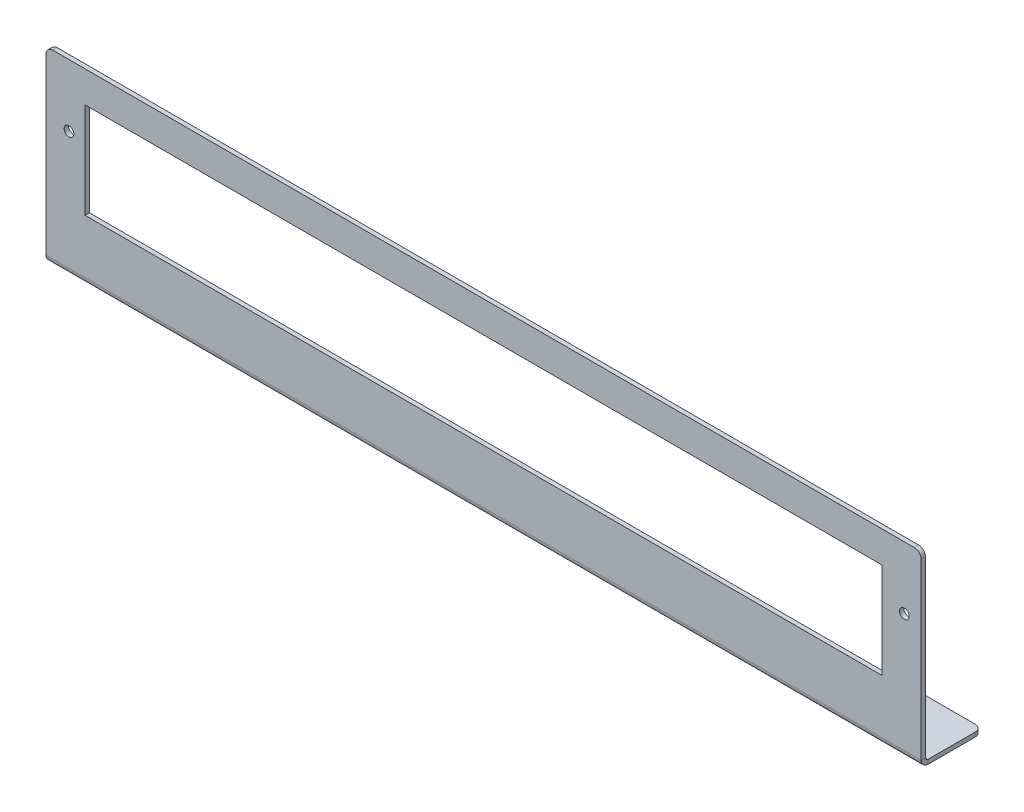
ISO-10303-21;
HEADER;
FILE_DESCRIPTION(('STEP AP214'),'2;1');
FILE_NAME('part.step','',(''),(''),'','','');
FILE_SCHEMA(('AUTOMOTIVE_DESIGN { 1 0 10303 214 1 1 1 1 }'));
ENDSEC;
DATA;
#1=APPLICATION_CONTEXT('core data for automotive mechanical design processes');
#2=APPLICATION_PROTOCOL_DEFINITION('international standard','automotive_design',2000,#1);
#3=PRODUCT_CONTEXT('',#1,'mechanical');
#4=PRODUCT('Part','Part','',(#3));
#5=PRODUCT_RELATED_PRODUCT_CATEGORY('part','',(#4));
#6=PRODUCT_DEFINITION_FORMATION('','',#4);
#7=PRODUCT_DEFINITION_CONTEXT('part definition',#1,'design');
#8=PRODUCT_DEFINITION('design','',#6,#7);
#9=PRODUCT_DEFINITION_SHAPE('','',#8);
#10=(LENGTH_UNIT() NAMED_UNIT(*) SI_UNIT(.MILLI.,.METRE.));
#11=(NAMED_UNIT(*) PLANE_ANGLE_UNIT() SI_UNIT($,.RADIAN.));
#12=(NAMED_UNIT(*) SI_UNIT($,.STERADIAN.) SOLID_ANGLE_UNIT());
#13=UNCERTAINTY_MEASURE_WITH_UNIT(LENGTH_MEASURE(1.E-05),#10,'distance_accuracy_value','');
#14=(GEOMETRIC_REPRESENTATION_CONTEXT(3) GLOBAL_UNCERTAINTY_ASSIGNED_CONTEXT((#13)) GLOBAL_UNIT_ASSIGNED_CONTEXT((#10,
#11,#12)) REPRESENTATION_CONTEXT('',''));
#15=CARTESIAN_POINT('',(0.,0.,0.));
#16=DIRECTION('',(0.,0.,1.));
#17=DIRECTION('',(1.,0.,0.));
#18=AXIS2_PLACEMENT_3D('',#15,#16,#17);
#19=CARTESIAN_POINT('',(-127.88,27.43,-1.27));
#20=DIRECTION('',(-1.,0.,0.));
#21=DIRECTION('',(0.,0.,1.));
#22=AXIS2_PLACEMENT_3D('',#19,#20,#21);
#23=PLANE('',#22);
#24=DIRECTION('',(0.,-1.,0.));
#25=VECTOR('',#24,1.);
#26=CARTESIAN_POINT('',(-127.88,27.43,0.));
#27=LINE('',#26,#25);
#28=CARTESIAN_POINT('',(-127.88,25.43,0.));
#29=VERTEX_POINT('',#28);
#30=CARTESIAN_POINT('',(-127.88,-25.4234,0.));
#31=VERTEX_POINT('',#30);
#32=EDGE_CURVE('E302',#29,#31,#27,.T.);
#33=ORIENTED_EDGE('',*,*,#32,.F.);
#34=DIRECTION('',(0.,0.,1.));
#35=VECTOR('',#34,1.);
#36=CARTESIAN_POINT('',(-127.88,25.43,-1.27));
#37=LINE('',#36,#35);
#38=CARTESIAN_POINT('',(-127.88,25.43,-1.27));
#39=VERTEX_POINT('',#38);
#40=EDGE_CURVE('E94',#29,#39,#37,.F.);
#41=ORIENTED_EDGE('',*,*,#40,.T.);
#42=DIRECTION('',(0.,-1.,0.));
#43=VECTOR('',#42,1.);
#44=CARTESIAN_POINT('',(-127.88,27.43,-1.27));
#45=LINE('',#44,#43);
#46=CARTESIAN_POINT('',(-127.88,-25.4234,-1.27));
#47=VERTEX_POINT('',#46);
#48=EDGE_CURVE('E312',#39,#47,#45,.T.);
#49=ORIENTED_EDGE('',*,*,#48,.T.);
#50=DIRECTION('',(0.,0.,1.));
#51=VECTOR('',#50,1.);
#52=CARTESIAN_POINT('',(-127.88,-25.4234,-1.27));
#53=LINE('',#52,#51);
#54=EDGE_CURVE('E249',#47,#31,#53,.T.);
#55=ORIENTED_EDGE('',*,*,#54,.T.);
#56=EDGE_LOOP('',(#33,#41,#49,#55));
#57=FACE_BOUND('',#56,.T.);
#58=ADVANCED_FACE('F70',(#57),#23,.T.);
#59=CARTESIAN_POINT('',(0.,0.,-1.27));
#60=DIRECTION('',(0.,0.,-1.));
#61=DIRECTION('',(-1.,0.,0.));
#62=AXIS2_PLACEMENT_3D('',#59,#60,#61);
#63=PLANE('',#62);
#64=CARTESIAN_POINT('',(122.95,9.24000000000001,-1.27));
#65=DIRECTION('',(0.,0.,-1.));
#66=DIRECTION('',(-1.,0.,0.));
#67=AXIS2_PLACEMENT_3D('',#64,#65,#66);
#68=CIRCLE('',#67,1.40969999999999);
#69=CARTESIAN_POINT('',(121.5403,9.24000000000001,-1.27));
#70=VERTEX_POINT('',#69);
#71=EDGE_CURVE('E587',#70,#70,#68,.T.);
#72=ORIENTED_EDGE('',*,*,#71,.F.);
#73=EDGE_LOOP('',(#72));
#74=FACE_BOUND('',#73,.T.);
#75=CARTESIAN_POINT('',(-121.16,9.24000000000001,-1.27));
#76=DIRECTION('',(0.,0.,-1.));
#77=DIRECTION('',(-1.,0.,0.));
#78=AXIS2_PLACEMENT_3D('',#75,#76,#77);
#79=CIRCLE('',#78,1.40969999999999);
#80=CARTESIAN_POINT('',(-122.5697,9.24000000000001,-1.27));
#81=VERTEX_POINT('',#80);
#82=EDGE_CURVE('E593',#81,#81,#79,.T.);
#83=ORIENTED_EDGE('',*,*,#82,.F.);
#84=EDGE_LOOP('',(#83));
#85=FACE_BOUND('',#84,.T.);
#86=DIRECTION('',(0.,-1.,0.));
#87=VECTOR('',#86,1.);
#88=CARTESIAN_POINT('',(-116.45,18.29,-1.27));
#89=LINE('',#88,#87);
#90=CARTESIAN_POINT('',(-116.45,18.29,-1.27));
#91=VERTEX_POINT('',#90);
#92=CARTESIAN_POINT('',(-116.45,-9.65000000000001,-1.27));
#93=VERTEX_POINT('',#92);
#94=EDGE_CURVE('E268',#91,#93,#89,.T.);
#95=ORIENTED_EDGE('',*,*,#94,.T.);
#96=DIRECTION('',(1.,0.,0.));
#97=VECTOR('',#96,1.);
#98=CARTESIAN_POINT('',(-116.45,-9.65000000000001,-1.27));
#99=LINE('',#98,#97);
#100=CARTESIAN_POINT('',(116.45,-9.65000000000001,-1.27));
#101=VERTEX_POINT('',#100);
#102=EDGE_CURVE('E272',#93,#101,#99,.T.);
#103=ORIENTED_EDGE('',*,*,#102,.T.);
#104=DIRECTION('',(0.,1.,0.));
#105=VECTOR('',#104,1.);
#106=CARTESIAN_POINT('',(116.45,18.29,-1.27));
#107=LINE('',#106,#105);
#108=CARTESIAN_POINT('',(116.45,18.29,-1.27));
#109=VERTEX_POINT('',#108);
#110=EDGE_CURVE('E277',#101,#109,#107,.T.);
#111=ORIENTED_EDGE('',*,*,#110,.T.);
#112=DIRECTION('',(-1.,0.,0.));
#113=VECTOR('',#112,1.);
#114=CARTESIAN_POINT('',(-116.45,18.29,-1.27));
#115=LINE('',#114,#113);
#116=EDGE_CURVE('E281',#109,#91,#115,.T.);
#117=ORIENTED_EDGE('',*,*,#116,.T.);
#118=EDGE_LOOP('',(#95,#103,#111,#117));
#119=FACE_BOUND('',#118,.T.);
#120=ORIENTED_EDGE('',*,*,#48,.F.);
#121=CARTESIAN_POINT('',(-125.88,25.43,-1.27));
#122=DIRECTION('',(0.,0.,-1.));
#123=DIRECTION('',(-1.,0.,0.));
#124=AXIS2_PLACEMENT_3D('',#121,#122,#123);
#125=CIRCLE('',#124,2.);
#126=CARTESIAN_POINT('',(-125.88,27.43,-1.27));
#127=VERTEX_POINT('',#126);
#128=EDGE_CURVE('E370',#39,#127,#125,.T.);
#129=ORIENTED_EDGE('',*,*,#128,.T.);
#130=DIRECTION('',(-1.,0.,0.));
#131=VECTOR('',#130,1.);
#132=CARTESIAN_POINT('',(127.88,27.43,-1.27));
#133=LINE('',#132,#131);
#134=CARTESIAN_POINT('',(125.88,27.43,-1.27));
#135=VERTEX_POINT('',#134);
#136=EDGE_CURVE('E319',#135,#127,#133,.T.);
#137=ORIENTED_EDGE('',*,*,#136,.F.);
#138=CARTESIAN_POINT('',(125.88,25.43,-1.27));
#139=DIRECTION('',(0.,0.,-1.));
#140=DIRECTION('',(-1.,0.,0.));
#141=AXIS2_PLACEMENT_3D('',#138,#139,#140);
#142=CIRCLE('',#141,2.);
#143=CARTESIAN_POINT('',(127.88,25.43,-1.27));
#144=VERTEX_POINT('',#143);
#145=EDGE_CURVE('E86',#135,#144,#142,.T.);
#146=ORIENTED_EDGE('',*,*,#145,.T.);
#147=DIRECTION('',(0.,1.,0.));
#148=VECTOR('',#147,1.);
#149=CARTESIAN_POINT('',(127.88,27.43,-1.27));
#150=LINE('',#149,#148);
#151=CARTESIAN_POINT('',(127.88,-25.4234,-1.27));
#152=VERTEX_POINT('',#151);
#153=EDGE_CURVE('E315',#152,#144,#150,.T.);
#154=ORIENTED_EDGE('',*,*,#153,.F.);
#155=DIRECTION('',(-1.,0.,0.));
#156=VECTOR('',#155,1.);
#157=CARTESIAN_POINT('',(-127.88,-25.4234,-1.27));
#158=LINE('',#157,#156);
#159=EDGE_CURVE('E254',#47,#152,#158,.F.);
#160=ORIENTED_EDGE('',*,*,#159,.F.);
#161=EDGE_LOOP('',(#120,#129,#137,#146,#154,#160));
#162=FACE_BOUND('',#161,.T.);
#163=ADVANCED_FACE('F398',(#74,#85,#119,#162),#63,.T.);
#164=CARTESIAN_POINT('',(0.,0.,0.));
#165=DIRECTION('',(0.,0.,-1.));
#166=DIRECTION('',(-1.,0.,0.));
#167=AXIS2_PLACEMENT_3D('',#164,#165,#166);
#168=PLANE('',#167);
#169=CARTESIAN_POINT('',(122.95,9.24000000000001,0.));
#170=DIRECTION('',(0.,0.,-1.));
#171=DIRECTION('',(-1.,0.,0.));
#172=AXIS2_PLACEMENT_3D('',#169,#170,#171);
#173=CIRCLE('',#172,1.40969999999999);
#174=CARTESIAN_POINT('',(121.5403,9.24000000000001,0.));
#175=VERTEX_POINT('',#174);
#176=EDGE_CURVE('E584',#175,#175,#173,.T.);
#177=ORIENTED_EDGE('',*,*,#176,.T.);
#178=EDGE_LOOP('',(#177));
#179=FACE_BOUND('',#178,.T.);
#180=CARTESIAN_POINT('',(-121.16,9.24000000000001,0.));
#181=DIRECTION('',(0.,0.,-1.));
#182=DIRECTION('',(-1.,0.,0.));
#183=AXIS2_PLACEMENT_3D('',#180,#181,#182);
#184=CIRCLE('',#183,1.40969999999999);
#185=CARTESIAN_POINT('',(-122.5697,9.24000000000001,0.));
#186=VERTEX_POINT('',#185);
#187=EDGE_CURVE('E244',#186,#186,#184,.T.);
#188=ORIENTED_EDGE('',*,*,#187,.T.);
#189=EDGE_LOOP('',(#188));
#190=FACE_BOUND('',#189,.T.);
#191=DIRECTION('',(1.,0.,0.));
#192=VECTOR('',#191,1.);
#193=CARTESIAN_POINT('',(-116.45,-9.65000000000001,0.));
#194=LINE('',#193,#192);
#195=CARTESIAN_POINT('',(-116.45,-9.65000000000001,0.));
#196=VERTEX_POINT('',#195);
#197=CARTESIAN_POINT('',(116.45,-9.65000000000001,0.));
#198=VERTEX_POINT('',#197);
#199=EDGE_CURVE('E288',#196,#198,#194,.T.);
#200=ORIENTED_EDGE('',*,*,#199,.F.);
#201=DIRECTION('',(0.,-1.,0.));
#202=VECTOR('',#201,1.);
#203=CARTESIAN_POINT('',(-116.45,18.29,0.));
#204=LINE('',#203,#202);
#205=CARTESIAN_POINT('',(-116.45,18.29,0.));
#206=VERTEX_POINT('',#205);
#207=EDGE_CURVE('E264',#206,#196,#204,.T.);
#208=ORIENTED_EDGE('',*,*,#207,.F.);
#209=DIRECTION('',(-1.,0.,0.));
#210=VECTOR('',#209,1.);
#211=CARTESIAN_POINT('',(-116.45,18.29,0.));
#212=LINE('',#211,#210);
#213=CARTESIAN_POINT('',(116.45,18.29,0.));
#214=VERTEX_POINT('',#213);
#215=EDGE_CURVE('E273',#214,#206,#212,.T.);
#216=ORIENTED_EDGE('',*,*,#215,.F.);
#217=DIRECTION('',(0.,1.,0.));
#218=VECTOR('',#217,1.);
#219=CARTESIAN_POINT('',(116.45,18.29,0.));
#220=LINE('',#219,#218);
#221=EDGE_CURVE('E292',#198,#214,#220,.T.);
#222=ORIENTED_EDGE('',*,*,#221,.F.);
#223=EDGE_LOOP('',(#200,#208,#216,#222));
#224=FACE_BOUND('',#223,.T.);
#225=DIRECTION('',(-1.,0.,0.));
#226=VECTOR('',#225,1.);
#227=CARTESIAN_POINT('',(127.88,27.43,0.));
#228=LINE('',#227,#226);
#229=CARTESIAN_POINT('',(125.88,27.43,0.));
#230=VERTEX_POINT('',#229);
#231=CARTESIAN_POINT('',(-125.88,27.43,0.));
#232=VERTEX_POINT('',#231);
#233=EDGE_CURVE('E316',#230,#232,#228,.T.);
#234=ORIENTED_EDGE('',*,*,#233,.T.);
#235=CARTESIAN_POINT('',(-125.88,25.43,0.));
#236=DIRECTION('',(0.,0.,-1.));
#237=DIRECTION('',(-1.,0.,0.));
#238=AXIS2_PLACEMENT_3D('',#235,#236,#237);
#239=CIRCLE('',#238,2.);
#240=EDGE_CURVE('E363',#232,#29,#239,.F.);
#241=ORIENTED_EDGE('',*,*,#240,.T.);
#242=ORIENTED_EDGE('',*,*,#32,.T.);
#243=DIRECTION('',(-1.,0.,0.));
#244=VECTOR('',#243,1.);
#245=CARTESIAN_POINT('',(-127.88,-25.4234,0.));
#246=LINE('',#245,#244);
#247=CARTESIAN_POINT('',(127.88,-25.4234,0.));
#248=VERTEX_POINT('',#247);
#249=EDGE_CURVE('E210',#31,#248,#246,.F.);
#250=ORIENTED_EDGE('',*,*,#249,.T.);
#251=DIRECTION('',(0.,1.,0.));
#252=VECTOR('',#251,1.);
#253=CARTESIAN_POINT('',(127.88,27.43,0.));
#254=LINE('',#253,#252);
#255=CARTESIAN_POINT('',(127.88,25.43,0.));
#256=VERTEX_POINT('',#255);
#257=EDGE_CURVE('E326',#248,#256,#254,.T.);
#258=ORIENTED_EDGE('',*,*,#257,.T.);
#259=CARTESIAN_POINT('',(125.88,25.43,0.));
#260=DIRECTION('',(0.,0.,-1.));
#261=DIRECTION('',(-1.,0.,0.));
#262=AXIS2_PLACEMENT_3D('',#259,#260,#261);
#263=CIRCLE('',#262,2.);
#264=EDGE_CURVE('E360',#256,#230,#263,.F.);
#265=ORIENTED_EDGE('',*,*,#264,.T.);
#266=EDGE_LOOP('',(#234,#241,#242,#250,#258,#265));
#267=FACE_BOUND('',#266,.T.);
#268=ADVANCED_FACE('F409',(#179,#190,#224,#267),#168,.F.);
#269=CARTESIAN_POINT('',(127.88,27.43,-1.27));
#270=DIRECTION('',(0.,1.,0.));
#271=DIRECTION('',(-1.,0.,0.));
#272=AXIS2_PLACEMENT_3D('',#269,#270,#271);
#273=PLANE('',#272);
#274=ORIENTED_EDGE('',*,*,#136,.T.);
#275=DIRECTION('',(0.,0.,1.));
#276=VECTOR('',#275,1.);
#277=CARTESIAN_POINT('',(-125.88,27.43,-1.27));
#278=LINE('',#277,#276);
#279=EDGE_CURVE('E356',#127,#232,#278,.T.);
#280=ORIENTED_EDGE('',*,*,#279,.T.);
#281=ORIENTED_EDGE('',*,*,#233,.F.);
#282=DIRECTION('',(0.,0.,1.));
#283=VECTOR('',#282,1.);
#284=CARTESIAN_POINT('',(125.88,27.43,-1.27));
#285=LINE('',#284,#283);
#286=EDGE_CURVE('E353',#230,#135,#285,.F.);
#287=ORIENTED_EDGE('',*,*,#286,.T.);
#288=EDGE_LOOP('',(#274,#280,#281,#287));
#289=FACE_BOUND('',#288,.T.);
#290=ADVANCED_FACE('F405',(#289),#273,.T.);
#291=CARTESIAN_POINT('',(127.88,27.43,-1.27));
#292=DIRECTION('',(1.,0.,0.));
#293=DIRECTION('',(0.,0.,-1.));
#294=AXIS2_PLACEMENT_3D('',#291,#292,#293);
#295=PLANE('',#294);
#296=ORIENTED_EDGE('',*,*,#153,.T.);
#297=DIRECTION('',(0.,0.,1.));
#298=VECTOR('',#297,1.);
#299=CARTESIAN_POINT('',(127.88,25.43,-1.27));
#300=LINE('',#299,#298);
#301=EDGE_CURVE('E13',#144,#256,#300,.T.);
#302=ORIENTED_EDGE('',*,*,#301,.T.);
#303=ORIENTED_EDGE('',*,*,#257,.F.);
#304=DIRECTION('',(1.50722647926306E-13,0.,1.));
#305=VECTOR('',#304,1.);
#306=CARTESIAN_POINT('',(127.88,-25.4234,-1.27));
#307=LINE('',#306,#305);
#308=EDGE_CURVE('E260',#152,#248,#307,.T.);
#309=ORIENTED_EDGE('',*,*,#308,.F.);
#310=EDGE_LOOP('',(#296,#302,#303,#309));
#311=FACE_BOUND('',#310,.T.);
#312=ADVANCED_FACE('F396',(#311),#295,.T.);
#313=CARTESIAN_POINT('',(-116.45,18.29,-1.27));
#314=DIRECTION('',(-1.,0.,0.));
#315=DIRECTION('',(0.,0.,1.));
#316=AXIS2_PLACEMENT_3D('',#313,#314,#315);
#317=PLANE('',#316);
#318=ORIENTED_EDGE('',*,*,#207,.T.);
#319=DIRECTION('',(0.,0.,1.));
#320=VECTOR('',#319,1.);
#321=CARTESIAN_POINT('',(-116.45,-9.65000000000001,-1.27));
#322=LINE('',#321,#320);
#323=EDGE_CURVE('E285',#93,#196,#322,.T.);
#324=ORIENTED_EDGE('',*,*,#323,.F.);
#325=ORIENTED_EDGE('',*,*,#94,.F.);
#326=DIRECTION('',(0.,0.,1.));
#327=VECTOR('',#326,1.);
#328=CARTESIAN_POINT('',(-116.45,18.29,-1.27));
#329=LINE('',#328,#327);
#330=EDGE_CURVE('E299',#91,#206,#329,.T.);
#331=ORIENTED_EDGE('',*,*,#330,.T.);
#332=EDGE_LOOP('',(#318,#324,#325,#331));
#333=FACE_BOUND('',#332,.T.);
#334=ADVANCED_FACE('F485',(#333),#317,.F.);
#335=CARTESIAN_POINT('',(-116.45,18.29,-1.27));
#336=DIRECTION('',(0.,1.,0.));
#337=DIRECTION('',(-1.,0.,0.));
#338=AXIS2_PLACEMENT_3D('',#335,#336,#337);
#339=PLANE('',#338);
#340=ORIENTED_EDGE('',*,*,#215,.T.);
#341=ORIENTED_EDGE('',*,*,#330,.F.);
#342=ORIENTED_EDGE('',*,*,#116,.F.);
#343=DIRECTION('',(0.,0.,1.));
#344=VECTOR('',#343,1.);
#345=CARTESIAN_POINT('',(116.45,18.29,-1.27));
#346=LINE('',#345,#344);
#347=EDGE_CURVE('E303',#109,#214,#346,.T.);
#348=ORIENTED_EDGE('',*,*,#347,.T.);
#349=EDGE_LOOP('',(#340,#341,#342,#348));
#350=FACE_BOUND('',#349,.T.);
#351=ADVANCED_FACE('F481',(#350),#339,.F.);
#352=CARTESIAN_POINT('',(116.45,18.29,-1.27));
#353=DIRECTION('',(1.,0.,0.));
#354=DIRECTION('',(0.,0.,-1.));
#355=AXIS2_PLACEMENT_3D('',#352,#353,#354);
#356=PLANE('',#355);
#357=ORIENTED_EDGE('',*,*,#221,.T.);
#358=ORIENTED_EDGE('',*,*,#347,.F.);
#359=ORIENTED_EDGE('',*,*,#110,.F.);
#360=DIRECTION('',(0.,0.,1.));
#361=VECTOR('',#360,1.);
#362=CARTESIAN_POINT('',(116.45,-9.65000000000001,-1.27));
#363=LINE('',#362,#361);
#364=EDGE_CURVE('E306',#101,#198,#363,.T.);
#365=ORIENTED_EDGE('',*,*,#364,.T.);
#366=EDGE_LOOP('',(#357,#358,#359,#365));
#367=FACE_BOUND('',#366,.T.);
#368=ADVANCED_FACE('F484',(#367),#356,.F.);
#369=CARTESIAN_POINT('',(-116.45,-9.65000000000001,-1.27));
#370=DIRECTION('',(0.,-1.,0.));
#371=DIRECTION('',(1.,0.,0.));
#372=AXIS2_PLACEMENT_3D('',#369,#370,#371);
#373=PLANE('',#372);
#374=ORIENTED_EDGE('',*,*,#199,.T.);
#375=ORIENTED_EDGE('',*,*,#364,.F.);
#376=ORIENTED_EDGE('',*,*,#102,.F.);
#377=ORIENTED_EDGE('',*,*,#323,.T.);
#378=EDGE_LOOP('',(#374,#375,#376,#377));
#379=FACE_BOUND('',#378,.T.);
#380=ADVANCED_FACE('F478',(#379),#373,.F.);
#381=CARTESIAN_POINT('',(127.88,-25.4234,-2.00659999999999));
#382=DIRECTION('',(1.,0.,0.));
#383=DIRECTION('',(0.,0.,-1.));
#384=AXIS2_PLACEMENT_3D('',#381,#382,#383);
#385=PLANE('',#384);
#386=DIRECTION('',(0.,-1.,0.));
#387=VECTOR('',#386,1.);
#388=CARTESIAN_POINT('',(127.88,-27.43,-2.00659999999999));
#389=LINE('',#388,#387);
#390=CARTESIAN_POINT('',(127.88,-26.16,-2.00659999999999));
#391=VERTEX_POINT('',#390);
#392=CARTESIAN_POINT('',(127.88,-27.43,-2.00659999999998));
#393=VERTEX_POINT('',#392);
#394=EDGE_CURVE('E240',#391,#393,#389,.T.);
#395=ORIENTED_EDGE('',*,*,#394,.F.);
#396=CARTESIAN_POINT('',(127.88,-25.4234,-2.00659999999999));
#397=DIRECTION('',(-1.,0.,0.));
#398=DIRECTION('',(0.,0.,1.));
#399=AXIS2_PLACEMENT_3D('',#396,#397,#398);
#400=CIRCLE('',#399,0.73659999999999);
#401=EDGE_CURVE('E214',#152,#391,#400,.F.);
#402=ORIENTED_EDGE('',*,*,#401,.F.);
#403=ORIENTED_EDGE('',*,*,#308,.T.);
#404=CARTESIAN_POINT('',(127.88,-25.4234,-2.00659999999999));
#405=DIRECTION('',(-1.,0.,0.));
#406=DIRECTION('',(0.,0.,1.));
#407=AXIS2_PLACEMENT_3D('',#404,#405,#406);
#408=CIRCLE('',#407,2.00659999999999);
#409=EDGE_CURVE('E247',#248,#393,#408,.F.);
#410=ORIENTED_EDGE('',*,*,#409,.T.);
#411=EDGE_LOOP('',(#395,#402,#403,#410));
#412=FACE_BOUND('',#411,.T.);
#413=ADVANCED_FACE('F393',(#412),#385,.T.);
#414=CARTESIAN_POINT('',(-127.88,-25.4234,-2.00659999999999));
#415=DIRECTION('',(1.,0.,0.));
#416=DIRECTION('',(0.,0.,-1.));
#417=AXIS2_PLACEMENT_3D('',#414,#415,#416);
#418=PLANE('',#417);
#419=CARTESIAN_POINT('',(-127.88,-25.4234,-2.00659999999999));
#420=DIRECTION('',(-1.,0.,0.));
#421=DIRECTION('',(0.,0.,1.));
#422=AXIS2_PLACEMENT_3D('',#419,#420,#421);
#423=CIRCLE('',#422,0.73659999999999);
#424=CARTESIAN_POINT('',(-127.88,-26.16,-2.00659999999999));
#425=VERTEX_POINT('',#424);
#426=EDGE_CURVE('E199',#425,#47,#423,.T.);
#427=ORIENTED_EDGE('',*,*,#426,.F.);
#428=DIRECTION('',(0.,-1.,0.));
#429=VECTOR('',#428,1.);
#430=CARTESIAN_POINT('',(-127.88,-26.16,-2.00659999999997));
#431=LINE('',#430,#429);
#432=CARTESIAN_POINT('',(-127.88,-27.43,-2.00659999999997));
#433=VERTEX_POINT('',#432);
#434=EDGE_CURVE('E192',#425,#433,#431,.T.);
#435=ORIENTED_EDGE('',*,*,#434,.T.);
#436=CARTESIAN_POINT('',(-127.88,-25.4234,-2.00659999999999));
#437=DIRECTION('',(-1.,0.,0.));
#438=DIRECTION('',(0.,0.,1.));
#439=AXIS2_PLACEMENT_3D('',#436,#437,#438);
#440=CIRCLE('',#439,2.00659999999999);
#441=EDGE_CURVE('E205',#433,#31,#440,.T.);
#442=ORIENTED_EDGE('',*,*,#441,.T.);
#443=ORIENTED_EDGE('',*,*,#54,.F.);
#444=EDGE_LOOP('',(#427,#435,#442,#443));
#445=FACE_BOUND('',#444,.T.);
#446=ADVANCED_FACE('F217',(#445),#418,.F.);
#447=CARTESIAN_POINT('',(-127.88,-25.4234,-2.00659999999999));
#448=DIRECTION('',(-1.,0.,0.));
#449=DIRECTION('',(0.,-1.,0.));
#450=AXIS2_PLACEMENT_3D('',#447,#448,#449);
#451=CYLINDRICAL_SURFACE('',#450,2.00659999999999);
#452=ORIENTED_EDGE('',*,*,#249,.F.);
#453=ORIENTED_EDGE('',*,*,#441,.F.);
#454=DIRECTION('',(-1.,0.,0.));
#455=VECTOR('',#454,1.);
#456=CARTESIAN_POINT('',(0.,-27.43,-2.00659999999998));
#457=LINE('',#456,#455);
#458=EDGE_CURVE('E208',#393,#433,#457,.T.);
#459=ORIENTED_EDGE('',*,*,#458,.F.);
#460=ORIENTED_EDGE('',*,*,#409,.F.);
#461=EDGE_LOOP('',(#452,#453,#459,#460));
#462=FACE_BOUND('',#461,.T.);
#463=ADVANCED_FACE('F206',(#462),#451,.T.);
#464=CARTESIAN_POINT('',(-127.88,-25.4234,-2.00659999999999));
#465=DIRECTION('',(-1.,0.,0.));
#466=DIRECTION('',(0.,-1.,0.));
#467=AXIS2_PLACEMENT_3D('',#464,#465,#466);
#468=CYLINDRICAL_SURFACE('',#467,0.73659999999999);
#469=ORIENTED_EDGE('',*,*,#159,.T.);
#470=ORIENTED_EDGE('',*,*,#401,.T.);
#471=DIRECTION('',(1.,0.,0.));
#472=VECTOR('',#471,1.);
#473=CARTESIAN_POINT('',(127.88,-26.16,-2.0066));
#474=LINE('',#473,#472);
#475=EDGE_CURVE('E220',#391,#425,#474,.F.);
#476=ORIENTED_EDGE('',*,*,#475,.T.);
#477=ORIENTED_EDGE('',*,*,#426,.T.);
#478=EDGE_LOOP('',(#469,#470,#476,#477));
#479=FACE_BOUND('',#478,.T.);
#480=ADVANCED_FACE('F389',(#479),#468,.F.);
#481=CARTESIAN_POINT('',(-127.88,-27.43,-1.27));
#482=DIRECTION('',(-1.,0.,0.));
#483=DIRECTION('',(0.,-1.,0.));
#484=AXIS2_PLACEMENT_3D('',#481,#482,#483);
#485=PLANE('',#484);
#486=DIRECTION('',(0.,0.,-1.));
#487=VECTOR('',#486,1.);
#488=CARTESIAN_POINT('',(-127.88,-26.16,0.));
#489=LINE('',#488,#487);
#490=CARTESIAN_POINT('',(-127.88,-26.1600000000001,-15.78));
#491=VERTEX_POINT('',#490);
#492=EDGE_CURVE('E387',#491,#425,#489,.F.);
#493=ORIENTED_EDGE('',*,*,#492,.F.);
#494=DIRECTION('',(0.,1.,0.));
#495=VECTOR('',#494,1.);
#496=CARTESIAN_POINT('',(-127.88,-27.4300000000001,-15.78));
#497=LINE('',#496,#495);
#498=CARTESIAN_POINT('',(-127.88,-27.4300000000001,-15.78));
#499=VERTEX_POINT('',#498);
#500=EDGE_CURVE('E194',#491,#499,#497,.F.);
#501=ORIENTED_EDGE('',*,*,#500,.T.);
#502=DIRECTION('',(0.,0.,1.));
#503=VECTOR('',#502,1.);
#504=CARTESIAN_POINT('',(-127.88,-27.43,-1.27));
#505=LINE('',#504,#503);
#506=EDGE_CURVE('E187',#499,#433,#505,.T.);
#507=ORIENTED_EDGE('',*,*,#506,.T.);
#508=ORIENTED_EDGE('',*,*,#434,.F.);
#509=EDGE_LOOP('',(#493,#501,#507,#508));
#510=FACE_BOUND('',#509,.T.);
#511=ADVANCED_FACE('F190',(#510),#485,.T.);
#512=CARTESIAN_POINT('',(127.88,-27.43,-17.78));
#513=DIRECTION('',(1.,0.,0.));
#514=DIRECTION('',(0.,1.,0.));
#515=AXIS2_PLACEMENT_3D('',#512,#513,#514);
#516=PLANE('',#515);
#517=DIRECTION('',(0.,0.,-1.));
#518=VECTOR('',#517,1.);
#519=CARTESIAN_POINT('',(127.88,-27.43,-17.78));
#520=LINE('',#519,#518);
#521=CARTESIAN_POINT('',(127.88,-27.43,-15.78));
#522=VERTEX_POINT('',#521);
#523=EDGE_CURVE('E225',#393,#522,#520,.T.);
#524=ORIENTED_EDGE('',*,*,#523,.T.);
#525=DIRECTION('',(0.,1.,0.));
#526=VECTOR('',#525,1.);
#527=CARTESIAN_POINT('',(127.88,-27.43,-15.78));
#528=LINE('',#527,#526);
#529=CARTESIAN_POINT('',(127.88,-26.16,-15.78));
#530=VERTEX_POINT('',#529);
#531=EDGE_CURVE('E79',#522,#530,#528,.T.);
#532=ORIENTED_EDGE('',*,*,#531,.T.);
#533=DIRECTION('',(0.,0.,1.));
#534=VECTOR('',#533,1.);
#535=CARTESIAN_POINT('',(127.88,-26.16,0.));
#536=LINE('',#535,#534);
#537=EDGE_CURVE('E227',#391,#530,#536,.F.);
#538=ORIENTED_EDGE('',*,*,#537,.F.);
#539=ORIENTED_EDGE('',*,*,#394,.T.);
#540=EDGE_LOOP('',(#524,#532,#538,#539));
#541=FACE_BOUND('',#540,.T.);
#542=ADVANCED_FACE('F379',(#541),#516,.T.);
#543=CARTESIAN_POINT('',(0.,-27.43,0.));
#544=DIRECTION('',(0.,-1.,0.));
#545=DIRECTION('',(0.,0.,-1.));
#546=AXIS2_PLACEMENT_3D('',#543,#544,#545);
#547=PLANE('',#546);
#548=ORIENTED_EDGE('',*,*,#506,.F.);
#549=CARTESIAN_POINT('',(-125.88,-27.4300000000001,-15.78));
#550=DIRECTION('',(0.,-1.,0.));
#551=DIRECTION('',(0.,0.,-1.));
#552=AXIS2_PLACEMENT_3D('',#549,#550,#551);
#553=CIRCLE('',#552,2.);
#554=CARTESIAN_POINT('',(-125.88,-27.4300000000001,-17.78));
#555=VERTEX_POINT('',#554);
#556=EDGE_CURVE('E350',#499,#555,#553,.T.);
#557=ORIENTED_EDGE('',*,*,#556,.T.);
#558=DIRECTION('',(-1.,0.,0.));
#559=VECTOR('',#558,1.);
#560=CARTESIAN_POINT('',(-127.88,-27.4300000000001,-17.78));
#561=LINE('',#560,#559);
#562=CARTESIAN_POINT('',(125.88,-27.43,-17.78));
#563=VERTEX_POINT('',#562);
#564=EDGE_CURVE('E200',#563,#555,#561,.T.);
#565=ORIENTED_EDGE('',*,*,#564,.F.);
#566=CARTESIAN_POINT('',(125.88,-27.43,-15.78));
#567=DIRECTION('',(0.,-1.,0.));
#568=DIRECTION('',(0.,0.,-1.));
#569=AXIS2_PLACEMENT_3D('',#566,#567,#568);
#570=CIRCLE('',#569,2.);
#571=EDGE_CURVE('E347',#563,#522,#570,.T.);
#572=ORIENTED_EDGE('',*,*,#571,.T.);
#573=ORIENTED_EDGE('',*,*,#523,.F.);
#574=ORIENTED_EDGE('',*,*,#458,.T.);
#575=EDGE_LOOP('',(#548,#557,#565,#572,#573,#574));
#576=FACE_BOUND('',#575,.T.);
#577=ADVANCED_FACE('F223',(#576),#547,.T.);
#578=CARTESIAN_POINT('',(0.,-26.16,0.));
#579=DIRECTION('',(0.,-1.,0.));
#580=DIRECTION('',(0.,0.,-1.));
#581=AXIS2_PLACEMENT_3D('',#578,#579,#580);
#582=PLANE('',#581);
#583=DIRECTION('',(1.,0.,0.));
#584=VECTOR('',#583,1.);
#585=CARTESIAN_POINT('',(0.,-26.1600000000001,-17.78));
#586=LINE('',#585,#584);
#587=CARTESIAN_POINT('',(125.88,-26.16,-17.78));
#588=VERTEX_POINT('',#587);
#589=CARTESIAN_POINT('',(-125.88,-26.1600000000001,-17.78));
#590=VERTEX_POINT('',#589);
#591=EDGE_CURVE('E233',#588,#590,#586,.F.);
#592=ORIENTED_EDGE('',*,*,#591,.T.);
#593=CARTESIAN_POINT('',(-125.88,-26.1600000000001,-15.78));
#594=DIRECTION('',(0.,-1.,0.));
#595=DIRECTION('',(0.,0.,-1.));
#596=AXIS2_PLACEMENT_3D('',#593,#594,#595);
#597=CIRCLE('',#596,2.);
#598=EDGE_CURVE('E342',#590,#491,#597,.F.);
#599=ORIENTED_EDGE('',*,*,#598,.T.);
#600=ORIENTED_EDGE('',*,*,#492,.T.);
#601=ORIENTED_EDGE('',*,*,#475,.F.);
#602=ORIENTED_EDGE('',*,*,#537,.T.);
#603=CARTESIAN_POINT('',(125.88,-26.16,-15.78));
#604=DIRECTION('',(0.,-1.,0.));
#605=DIRECTION('',(0.,0.,-1.));
#606=AXIS2_PLACEMENT_3D('',#603,#604,#605);
#607=CIRCLE('',#606,2.);
#608=EDGE_CURVE('E339',#530,#588,#607,.F.);
#609=ORIENTED_EDGE('',*,*,#608,.T.);
#610=EDGE_LOOP('',(#592,#599,#600,#601,#602,#609));
#611=FACE_BOUND('',#610,.T.);
#612=ADVANCED_FACE('F385',(#611),#582,.F.);
#613=CARTESIAN_POINT('',(-127.88,-27.4300000000001,-17.78));
#614=DIRECTION('',(0.,0.,-1.));
#615=DIRECTION('',(0.,1.,0.));
#616=AXIS2_PLACEMENT_3D('',#613,#614,#615);
#617=PLANE('',#616);
#618=ORIENTED_EDGE('',*,*,#564,.T.);
#619=DIRECTION('',(0.,1.,0.));
#620=VECTOR('',#619,1.);
#621=CARTESIAN_POINT('',(-125.88,-27.4300000000001,-17.78));
#622=LINE('',#621,#620);
#623=EDGE_CURVE('E335',#555,#590,#622,.T.);
#624=ORIENTED_EDGE('',*,*,#623,.T.);
#625=ORIENTED_EDGE('',*,*,#591,.F.);
#626=DIRECTION('',(0.,1.,0.));
#627=VECTOR('',#626,1.);
#628=CARTESIAN_POINT('',(125.88,-27.43,-17.78));
#629=LINE('',#628,#627);
#630=EDGE_CURVE('E323',#588,#563,#629,.F.);
#631=ORIENTED_EDGE('',*,*,#630,.T.);
#632=EDGE_LOOP('',(#618,#624,#625,#631));
#633=FACE_BOUND('',#632,.T.);
#634=ADVANCED_FACE('F457',(#633),#617,.T.);
#635=CARTESIAN_POINT('',(-121.16,9.24000000000001,-1.27));
#636=DIRECTION('',(0.,0.,-1.));
#637=DIRECTION('',(-1.,0.,0.));
#638=AXIS2_PLACEMENT_3D('',#635,#636,#637);
#639=CYLINDRICAL_SURFACE('',#638,1.40969999999999);
#640=ORIENTED_EDGE('',*,*,#187,.F.);
#641=EDGE_LOOP('',(#640));
#642=FACE_BOUND('',#641,.T.);
#643=ORIENTED_EDGE('',*,*,#82,.T.);
#644=EDGE_LOOP('',(#643));
#645=FACE_BOUND('',#644,.T.);
#646=ADVANCED_FACE('F459',(#642,#645),#639,.F.);
#647=CARTESIAN_POINT('',(122.95,9.24000000000001,-1.27));
#648=DIRECTION('',(0.,0.,-1.));
#649=DIRECTION('',(-1.,0.,0.));
#650=AXIS2_PLACEMENT_3D('',#647,#648,#649);
#651=CYLINDRICAL_SURFACE('',#650,1.40969999999999);
#652=ORIENTED_EDGE('',*,*,#176,.F.);
#653=EDGE_LOOP('',(#652));
#654=FACE_BOUND('',#653,.T.);
#655=ORIENTED_EDGE('',*,*,#71,.T.);
#656=EDGE_LOOP('',(#655));
#657=FACE_BOUND('',#656,.T.);
#658=ADVANCED_FACE('F432',(#654,#657),#651,.F.);
#659=CARTESIAN_POINT('',(-125.88,-27.4300000000001,-15.78));
#660=DIRECTION('',(0.,1.,0.));
#661=DIRECTION('',(0.,0.,1.));
#662=AXIS2_PLACEMENT_3D('',#659,#660,#661);
#663=CYLINDRICAL_SURFACE('',#662,2.);
#664=ORIENTED_EDGE('',*,*,#556,.F.);
#665=ORIENTED_EDGE('',*,*,#500,.F.);
#666=ORIENTED_EDGE('',*,*,#598,.F.);
#667=ORIENTED_EDGE('',*,*,#623,.F.);
#668=EDGE_LOOP('',(#664,#665,#666,#667));
#669=FACE_BOUND('',#668,.T.);
#670=ADVANCED_FACE('F429',(#669),#663,.T.);
#671=CARTESIAN_POINT('',(-125.88,25.43,-1.27));
#672=DIRECTION('',(0.,0.,1.));
#673=DIRECTION('',(1.,0.,0.));
#674=AXIS2_PLACEMENT_3D('',#671,#672,#673);
#675=CYLINDRICAL_SURFACE('',#674,2.);
#676=ORIENTED_EDGE('',*,*,#128,.F.);
#677=ORIENTED_EDGE('',*,*,#40,.F.);
#678=ORIENTED_EDGE('',*,*,#240,.F.);
#679=ORIENTED_EDGE('',*,*,#279,.F.);
#680=EDGE_LOOP('',(#676,#677,#678,#679));
#681=FACE_BOUND('',#680,.T.);
#682=ADVANCED_FACE('F402',(#681),#675,.T.);
#683=CARTESIAN_POINT('',(125.88,-27.43,-15.78));
#684=DIRECTION('',(0.,1.,0.));
#685=DIRECTION('',(0.,0.,1.));
#686=AXIS2_PLACEMENT_3D('',#683,#684,#685);
#687=CYLINDRICAL_SURFACE('',#686,2.);
#688=ORIENTED_EDGE('',*,*,#571,.F.);
#689=ORIENTED_EDGE('',*,*,#630,.F.);
#690=ORIENTED_EDGE('',*,*,#608,.F.);
#691=ORIENTED_EDGE('',*,*,#531,.F.);
#692=EDGE_LOOP('',(#688,#689,#690,#691));
#693=FACE_BOUND('',#692,.T.);
#694=ADVANCED_FACE('F435',(#693),#687,.T.);
#695=CARTESIAN_POINT('',(125.88,25.43,-1.27));
#696=DIRECTION('',(0.,0.,1.));
#697=DIRECTION('',(1.,0.,0.));
#698=AXIS2_PLACEMENT_3D('',#695,#696,#697);
#699=CYLINDRICAL_SURFACE('',#698,2.);
#700=ORIENTED_EDGE('',*,*,#145,.F.);
#701=ORIENTED_EDGE('',*,*,#286,.F.);
#702=ORIENTED_EDGE('',*,*,#264,.F.);
#703=ORIENTED_EDGE('',*,*,#301,.F.);
#704=EDGE_LOOP('',(#700,#701,#702,#703));
#705=FACE_BOUND('',#704,.T.);
#706=ADVANCED_FACE('F72',(#705),#699,.T.);
#707=CLOSED_SHELL('',(#58,#163,#268,#290,#312,#334,#351,#368,#380,#413,#446,#463,#480,#511,#542,
#577,#612,#634,#646,#658,#670,#682,#694,#706));
#708=MANIFOLD_SOLID_BREP('B2',#707);
#709=ADVANCED_BREP_SHAPE_REPRESENTATION('',(#18,#708),#14);
#710=SHAPE_DEFINITION_REPRESENTATION(#9,#709);
ENDSEC;
END-ISO-10303-21;
